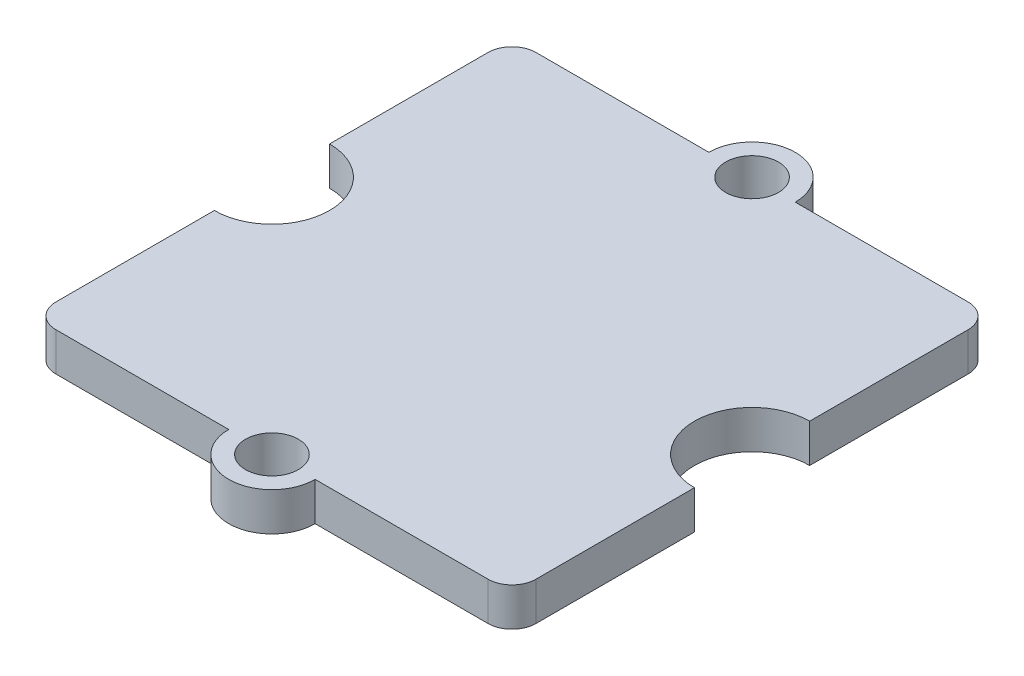
ISO-10303-21;
HEADER;
FILE_DESCRIPTION(('STEP AP214'),'2;1');
FILE_NAME('part.step','',(''),(''),'','','');
FILE_SCHEMA(('AUTOMOTIVE_DESIGN { 1 0 10303 214 1 1 1 1 }'));
ENDSEC;
DATA;
#1=APPLICATION_CONTEXT('core data for automotive mechanical design processes');
#2=APPLICATION_PROTOCOL_DEFINITION('international standard','automotive_design',2000,#1);
#3=PRODUCT_CONTEXT('',#1,'mechanical');
#4=PRODUCT('Part','Part','',(#3));
#5=PRODUCT_RELATED_PRODUCT_CATEGORY('part','',(#4));
#6=PRODUCT_DEFINITION_FORMATION('','',#4);
#7=PRODUCT_DEFINITION_CONTEXT('part definition',#1,'design');
#8=PRODUCT_DEFINITION('design','',#6,#7);
#9=PRODUCT_DEFINITION_SHAPE('','',#8);
#10=(LENGTH_UNIT() NAMED_UNIT(*) SI_UNIT(.MILLI.,.METRE.));
#11=(NAMED_UNIT(*) PLANE_ANGLE_UNIT() SI_UNIT($,.RADIAN.));
#12=(NAMED_UNIT(*) SI_UNIT($,.STERADIAN.) SOLID_ANGLE_UNIT());
#13=UNCERTAINTY_MEASURE_WITH_UNIT(LENGTH_MEASURE(1.E-05),#10,'distance_accuracy_value','');
#14=(GEOMETRIC_REPRESENTATION_CONTEXT(3) GLOBAL_UNCERTAINTY_ASSIGNED_CONTEXT((#13)) GLOBAL_UNIT_ASSIGNED_CONTEXT((#10,
#11,#12)) REPRESENTATION_CONTEXT('',''));
#15=CARTESIAN_POINT('',(0.,0.,0.));
#16=DIRECTION('',(0.,0.,1.));
#17=DIRECTION('',(1.,0.,0.));
#18=AXIS2_PLACEMENT_3D('',#15,#16,#17);
#19=CARTESIAN_POINT('',(0.,1.6,10.));
#20=DIRECTION('',(0.,-1.,0.));
#21=DIRECTION('',(0.,0.,-1.));
#22=AXIS2_PLACEMENT_3D('',#19,#20,#21);
#23=CYLINDRICAL_SURFACE('',#22,1.8);
#24=CARTESIAN_POINT('',(0.,0.,10.));
#25=DIRECTION('',(0.,1.,0.));
#26=DIRECTION('',(0.,0.,1.));
#27=AXIS2_PLACEMENT_3D('',#24,#25,#26);
#28=CIRCLE('',#27,1.8);
#29=CARTESIAN_POINT('',(-1.8,0.,10.));
#30=VERTEX_POINT('',#29);
#31=CARTESIAN_POINT('',(1.8,0.,10.));
#32=VERTEX_POINT('',#31);
#33=EDGE_CURVE('E187',#30,#32,#28,.T.);
#34=ORIENTED_EDGE('',*,*,#33,.T.);
#35=DIRECTION('',(0.,-1.,0.));
#36=VECTOR('',#35,1.);
#37=CARTESIAN_POINT('',(1.8,1.6,10.));
#38=LINE('',#37,#36);
#39=CARTESIAN_POINT('',(1.8,1.6,10.));
#40=VERTEX_POINT('',#39);
#41=EDGE_CURVE('E11',#40,#32,#38,.T.);
#42=ORIENTED_EDGE('',*,*,#41,.F.);
#43=CARTESIAN_POINT('',(0.,1.6,10.));
#44=DIRECTION('',(0.,1.,0.));
#45=DIRECTION('',(0.,0.,1.));
#46=AXIS2_PLACEMENT_3D('',#43,#44,#45);
#47=CIRCLE('',#46,1.8);
#48=CARTESIAN_POINT('',(-1.8,1.6,10.));
#49=VERTEX_POINT('',#48);
#50=EDGE_CURVE('E228',#49,#40,#47,.T.);
#51=ORIENTED_EDGE('',*,*,#50,.F.);
#52=DIRECTION('',(0.,-1.,0.));
#53=VECTOR('',#52,1.);
#54=CARTESIAN_POINT('',(-1.8,1.6,10.));
#55=LINE('',#54,#53);
#56=EDGE_CURVE('E186',#49,#30,#55,.T.);
#57=ORIENTED_EDGE('',*,*,#56,.T.);
#58=EDGE_LOOP('',(#34,#42,#51,#57));
#59=FACE_BOUND('',#58,.T.);
#60=ADVANCED_FACE('F36',(#59),#23,.T.);
#61=CARTESIAN_POINT('',(0.,1.6,10.));
#62=DIRECTION('',(0.,0.,-1.));
#63=DIRECTION('',(-1.,0.,0.));
#64=AXIS2_PLACEMENT_3D('',#61,#62,#63);
#65=PLANE('',#64);
#66=DIRECTION('',(1.,0.,0.));
#67=VECTOR('',#66,1.);
#68=CARTESIAN_POINT('',(0.,0.,10.));
#69=LINE('',#68,#67);
#70=CARTESIAN_POINT('',(8.99999999999999,0.,10.));
#71=VERTEX_POINT('',#70);
#72=EDGE_CURVE('E190',#32,#71,#69,.T.);
#73=ORIENTED_EDGE('',*,*,#72,.T.);
#74=DIRECTION('',(0.,-1.,0.));
#75=VECTOR('',#74,1.);
#76=CARTESIAN_POINT('',(8.99999999999999,1.6,10.));
#77=LINE('',#76,#75);
#78=CARTESIAN_POINT('',(8.99999999999999,1.6,10.));
#79=VERTEX_POINT('',#78);
#80=EDGE_CURVE('E44',#79,#71,#77,.T.);
#81=ORIENTED_EDGE('',*,*,#80,.F.);
#82=DIRECTION('',(1.,0.,0.));
#83=VECTOR('',#82,1.);
#84=CARTESIAN_POINT('',(0.,1.6,10.));
#85=LINE('',#84,#83);
#86=EDGE_CURVE('E115',#40,#79,#85,.T.);
#87=ORIENTED_EDGE('',*,*,#86,.F.);
#88=ORIENTED_EDGE('',*,*,#41,.T.);
#89=EDGE_LOOP('',(#73,#81,#87,#88));
#90=FACE_BOUND('',#89,.T.);
#91=ADVANCED_FACE('F308',(#90),#65,.F.);
#92=CARTESIAN_POINT('',(9.,1.6,9.00000000000001));
#93=DIRECTION('',(0.,-1.,0.));
#94=DIRECTION('',(0.,0.,-1.));
#95=AXIS2_PLACEMENT_3D('',#92,#93,#94);
#96=CYLINDRICAL_SURFACE('',#95,1.);
#97=CARTESIAN_POINT('',(9.,0.,9.00000000000001));
#98=DIRECTION('',(0.,1.,0.));
#99=DIRECTION('',(0.,0.,1.));
#100=AXIS2_PLACEMENT_3D('',#97,#98,#99);
#101=CIRCLE('',#100,1.);
#102=CARTESIAN_POINT('',(10.,0.,9.));
#103=VERTEX_POINT('',#102);
#104=EDGE_CURVE('E192',#71,#103,#101,.T.);
#105=ORIENTED_EDGE('',*,*,#104,.T.);
#106=DIRECTION('',(0.,-1.,0.));
#107=VECTOR('',#106,1.);
#108=CARTESIAN_POINT('',(10.,1.6,9.));
#109=LINE('',#108,#107);
#110=CARTESIAN_POINT('',(10.,1.6,9.));
#111=VERTEX_POINT('',#110);
#112=EDGE_CURVE('E250',#111,#103,#109,.T.);
#113=ORIENTED_EDGE('',*,*,#112,.F.);
#114=CARTESIAN_POINT('',(9.,1.6,9.00000000000001));
#115=DIRECTION('',(0.,1.,0.));
#116=DIRECTION('',(0.,0.,1.));
#117=AXIS2_PLACEMENT_3D('',#114,#115,#116);
#118=CIRCLE('',#117,1.);
#119=EDGE_CURVE('E258',#79,#111,#118,.T.);
#120=ORIENTED_EDGE('',*,*,#119,.F.);
#121=ORIENTED_EDGE('',*,*,#80,.T.);
#122=EDGE_LOOP('',(#105,#113,#120,#121));
#123=FACE_BOUND('',#122,.T.);
#124=ADVANCED_FACE('F256',(#123),#96,.T.);
#125=CARTESIAN_POINT('',(10.,1.6,0.));
#126=DIRECTION('',(-1.,0.,0.));
#127=DIRECTION('',(0.,0.,1.));
#128=AXIS2_PLACEMENT_3D('',#125,#126,#127);
#129=PLANE('',#128);
#130=DIRECTION('',(0.,0.,-1.));
#131=VECTOR('',#130,1.);
#132=CARTESIAN_POINT('',(10.,0.,0.));
#133=LINE('',#132,#131);
#134=CARTESIAN_POINT('',(10.,0.,2.40000000000001));
#135=VERTEX_POINT('',#134);
#136=EDGE_CURVE('E194',#103,#135,#133,.T.);
#137=ORIENTED_EDGE('',*,*,#136,.T.);
#138=DIRECTION('',(0.,-1.,0.));
#139=VECTOR('',#138,1.);
#140=CARTESIAN_POINT('',(10.,1.6,2.40000000000001));
#141=LINE('',#140,#139);
#142=CARTESIAN_POINT('',(10.,1.6,2.40000000000001));
#143=VERTEX_POINT('',#142);
#144=EDGE_CURVE('E248',#143,#135,#141,.T.);
#145=ORIENTED_EDGE('',*,*,#144,.F.);
#146=DIRECTION('',(0.,0.,-1.));
#147=VECTOR('',#146,1.);
#148=CARTESIAN_POINT('',(10.,1.6,0.));
#149=LINE('',#148,#147);
#150=EDGE_CURVE('E271',#111,#143,#149,.T.);
#151=ORIENTED_EDGE('',*,*,#150,.F.);
#152=ORIENTED_EDGE('',*,*,#112,.T.);
#153=EDGE_LOOP('',(#137,#145,#151,#152));
#154=FACE_BOUND('',#153,.T.);
#155=ADVANCED_FACE('F268',(#154),#129,.F.);
#156=CARTESIAN_POINT('',(10.,1.6,0.));
#157=DIRECTION('',(0.,-1.,0.));
#158=DIRECTION('',(0.,0.,-1.));
#159=AXIS2_PLACEMENT_3D('',#156,#157,#158);
#160=CYLINDRICAL_SURFACE('',#159,2.4);
#161=CARTESIAN_POINT('',(10.,0.,0.));
#162=DIRECTION('',(0.,1.,0.));
#163=DIRECTION('',(0.,0.,1.));
#164=AXIS2_PLACEMENT_3D('',#161,#162,#163);
#165=CIRCLE('',#164,2.4);
#166=CARTESIAN_POINT('',(10.,0.,-2.39999999999999));
#167=VERTEX_POINT('',#166);
#168=EDGE_CURVE('E197',#167,#135,#165,.T.);
#169=ORIENTED_EDGE('',*,*,#168,.F.);
#170=DIRECTION('',(0.,-1.,0.));
#171=VECTOR('',#170,1.);
#172=CARTESIAN_POINT('',(10.,1.6,-2.39999999999999));
#173=LINE('',#172,#171);
#174=CARTESIAN_POINT('',(10.,1.6,-2.39999999999999));
#175=VERTEX_POINT('',#174);
#176=EDGE_CURVE('E246',#175,#167,#173,.T.);
#177=ORIENTED_EDGE('',*,*,#176,.F.);
#178=CARTESIAN_POINT('',(10.,1.6,0.));
#179=DIRECTION('',(0.,1.,0.));
#180=DIRECTION('',(0.,0.,1.));
#181=AXIS2_PLACEMENT_3D('',#178,#179,#180);
#182=CIRCLE('',#181,2.4);
#183=EDGE_CURVE('E273',#175,#143,#182,.T.);
#184=ORIENTED_EDGE('',*,*,#183,.T.);
#185=ORIENTED_EDGE('',*,*,#144,.T.);
#186=EDGE_LOOP('',(#169,#177,#184,#185));
#187=FACE_BOUND('',#186,.T.);
#188=ADVANCED_FACE('F334',(#187),#160,.F.);
#189=CARTESIAN_POINT('',(10.,0.,-8.99999999999999));
#190=VERTEX_POINT('',#189);
#191=EDGE_CURVE('E198',#167,#190,#133,.T.);
#192=ORIENTED_EDGE('',*,*,#191,.T.);
#193=DIRECTION('',(0.,-1.,0.));
#194=VECTOR('',#193,1.);
#195=CARTESIAN_POINT('',(10.,1.6,-8.99999999999999));
#196=LINE('',#195,#194);
#197=CARTESIAN_POINT('',(10.,1.6,-8.99999999999999));
#198=VERTEX_POINT('',#197);
#199=EDGE_CURVE('E244',#198,#190,#196,.T.);
#200=ORIENTED_EDGE('',*,*,#199,.F.);
#201=EDGE_CURVE('E275',#175,#198,#149,.T.);
#202=ORIENTED_EDGE('',*,*,#201,.F.);
#203=ORIENTED_EDGE('',*,*,#176,.T.);
#204=EDGE_LOOP('',(#192,#200,#202,#203));
#205=FACE_BOUND('',#204,.T.);
#206=ADVANCED_FACE('F336',(#205),#129,.F.);
#207=CARTESIAN_POINT('',(9.,1.6,-8.99999999999999));
#208=DIRECTION('',(0.,-1.,0.));
#209=DIRECTION('',(0.,0.,-1.));
#210=AXIS2_PLACEMENT_3D('',#207,#208,#209);
#211=CYLINDRICAL_SURFACE('',#210,1.);
#212=CARTESIAN_POINT('',(9.,0.,-8.99999999999999));
#213=DIRECTION('',(0.,1.,0.));
#214=DIRECTION('',(0.,0.,1.));
#215=AXIS2_PLACEMENT_3D('',#212,#213,#214);
#216=CIRCLE('',#215,1.);
#217=CARTESIAN_POINT('',(8.99999999999999,0.,-9.99999999999999));
#218=VERTEX_POINT('',#217);
#219=EDGE_CURVE('E201',#218,#190,#216,.F.);
#220=ORIENTED_EDGE('',*,*,#219,.F.);
#221=DIRECTION('',(0.,-1.,0.));
#222=VECTOR('',#221,1.);
#223=CARTESIAN_POINT('',(8.99999999999999,1.6,-9.99999999999999));
#224=LINE('',#223,#222);
#225=CARTESIAN_POINT('',(8.99999999999999,1.6,-9.99999999999999));
#226=VERTEX_POINT('',#225);
#227=EDGE_CURVE('E242',#226,#218,#224,.T.);
#228=ORIENTED_EDGE('',*,*,#227,.F.);
#229=CARTESIAN_POINT('',(9.,1.6,-8.99999999999999));
#230=DIRECTION('',(0.,1.,0.));
#231=DIRECTION('',(0.,0.,1.));
#232=AXIS2_PLACEMENT_3D('',#229,#230,#231);
#233=CIRCLE('',#232,1.);
#234=EDGE_CURVE('E278',#226,#198,#233,.F.);
#235=ORIENTED_EDGE('',*,*,#234,.T.);
#236=ORIENTED_EDGE('',*,*,#199,.T.);
#237=EDGE_LOOP('',(#220,#228,#235,#236));
#238=FACE_BOUND('',#237,.T.);
#239=ADVANCED_FACE('F347',(#238),#211,.T.);
#240=CARTESIAN_POINT('',(0.,1.6,-9.99999999999999));
#241=DIRECTION('',(0.,0.,-1.));
#242=DIRECTION('',(-1.,0.,0.));
#243=AXIS2_PLACEMENT_3D('',#240,#241,#242);
#244=PLANE('',#243);
#245=DIRECTION('',(1.,0.,0.));
#246=VECTOR('',#245,1.);
#247=CARTESIAN_POINT('',(0.,0.,-9.99999999999999));
#248=LINE('',#247,#246);
#249=CARTESIAN_POINT('',(1.8,0.,-9.99999999999999));
#250=VERTEX_POINT('',#249);
#251=EDGE_CURVE('E204',#250,#218,#248,.T.);
#252=ORIENTED_EDGE('',*,*,#251,.F.);
#253=DIRECTION('',(0.,-1.,0.));
#254=VECTOR('',#253,1.);
#255=CARTESIAN_POINT('',(1.8,1.6,-9.99999999999999));
#256=LINE('',#255,#254);
#257=CARTESIAN_POINT('',(1.8,1.6,-9.99999999999999));
#258=VERTEX_POINT('',#257);
#259=EDGE_CURVE('E240',#258,#250,#256,.T.);
#260=ORIENTED_EDGE('',*,*,#259,.F.);
#261=DIRECTION('',(1.,0.,0.));
#262=VECTOR('',#261,1.);
#263=CARTESIAN_POINT('',(0.,1.6,-9.99999999999999));
#264=LINE('',#263,#262);
#265=EDGE_CURVE('E283',#258,#226,#264,.T.);
#266=ORIENTED_EDGE('',*,*,#265,.T.);
#267=ORIENTED_EDGE('',*,*,#227,.T.);
#268=EDGE_LOOP('',(#252,#260,#266,#267));
#269=FACE_BOUND('',#268,.T.);
#270=ADVANCED_FACE('F353',(#269),#244,.T.);
#271=CARTESIAN_POINT('',(0.,1.6,-9.99999999999999));
#272=DIRECTION('',(0.,-1.,0.));
#273=DIRECTION('',(0.,0.,-1.));
#274=AXIS2_PLACEMENT_3D('',#271,#272,#273);
#275=CYLINDRICAL_SURFACE('',#274,1.8);
#276=CARTESIAN_POINT('',(0.,0.,-9.99999999999999));
#277=DIRECTION('',(0.,1.,0.));
#278=DIRECTION('',(0.,0.,1.));
#279=AXIS2_PLACEMENT_3D('',#276,#277,#278);
#280=CIRCLE('',#279,1.8);
#281=CARTESIAN_POINT('',(-1.8,0.,-9.99999999999999));
#282=VERTEX_POINT('',#281);
#283=EDGE_CURVE('E207',#250,#282,#280,.T.);
#284=ORIENTED_EDGE('',*,*,#283,.T.);
#285=DIRECTION('',(0.,-1.,0.));
#286=VECTOR('',#285,1.);
#287=CARTESIAN_POINT('',(-1.8,1.6,-9.99999999999999));
#288=LINE('',#287,#286);
#289=CARTESIAN_POINT('',(-1.8,1.6,-9.99999999999999));
#290=VERTEX_POINT('',#289);
#291=EDGE_CURVE('E238',#290,#282,#288,.T.);
#292=ORIENTED_EDGE('',*,*,#291,.F.);
#293=CARTESIAN_POINT('',(0.,1.6,-9.99999999999999));
#294=DIRECTION('',(0.,1.,0.));
#295=DIRECTION('',(0.,0.,1.));
#296=AXIS2_PLACEMENT_3D('',#293,#294,#295);
#297=CIRCLE('',#296,1.8);
#298=EDGE_CURVE('E287',#258,#290,#297,.T.);
#299=ORIENTED_EDGE('',*,*,#298,.F.);
#300=ORIENTED_EDGE('',*,*,#259,.T.);
#301=EDGE_LOOP('',(#284,#292,#299,#300));
#302=FACE_BOUND('',#301,.T.);
#303=ADVANCED_FACE('F359',(#302),#275,.T.);
#304=CARTESIAN_POINT('',(-8.99999999999999,0.,-9.99999999999999));
#305=VERTEX_POINT('',#304);
#306=EDGE_CURVE('E208',#305,#282,#248,.T.);
#307=ORIENTED_EDGE('',*,*,#306,.F.);
#308=DIRECTION('',(0.,-1.,0.));
#309=VECTOR('',#308,1.);
#310=CARTESIAN_POINT('',(-8.99999999999999,1.6,-9.99999999999999));
#311=LINE('',#310,#309);
#312=CARTESIAN_POINT('',(-8.99999999999999,1.6,-9.99999999999999));
#313=VERTEX_POINT('',#312);
#314=EDGE_CURVE('E236',#313,#305,#311,.T.);
#315=ORIENTED_EDGE('',*,*,#314,.F.);
#316=EDGE_CURVE('E289',#313,#290,#264,.T.);
#317=ORIENTED_EDGE('',*,*,#316,.T.);
#318=ORIENTED_EDGE('',*,*,#291,.T.);
#319=EDGE_LOOP('',(#307,#315,#317,#318));
#320=FACE_BOUND('',#319,.T.);
#321=ADVANCED_FACE('F362',(#320),#244,.T.);
#322=CARTESIAN_POINT('',(-9.,1.6,-8.99999999999999));
#323=DIRECTION('',(0.,-1.,0.));
#324=DIRECTION('',(0.,0.,-1.));
#325=AXIS2_PLACEMENT_3D('',#322,#323,#324);
#326=CYLINDRICAL_SURFACE('',#325,1.);
#327=CARTESIAN_POINT('',(-9.,0.,-8.99999999999999));
#328=DIRECTION('',(0.,1.,0.));
#329=DIRECTION('',(0.,0.,1.));
#330=AXIS2_PLACEMENT_3D('',#327,#328,#329);
#331=CIRCLE('',#330,1.);
#332=CARTESIAN_POINT('',(-10.,0.,-8.99999999999999));
#333=VERTEX_POINT('',#332);
#334=EDGE_CURVE('E211',#333,#305,#331,.F.);
#335=ORIENTED_EDGE('',*,*,#334,.F.);
#336=DIRECTION('',(0.,-1.,0.));
#337=VECTOR('',#336,1.);
#338=CARTESIAN_POINT('',(-10.,1.6,-8.99999999999999));
#339=LINE('',#338,#337);
#340=CARTESIAN_POINT('',(-10.,1.6,-8.99999999999999));
#341=VERTEX_POINT('',#340);
#342=EDGE_CURVE('E234',#341,#333,#339,.T.);
#343=ORIENTED_EDGE('',*,*,#342,.F.);
#344=CARTESIAN_POINT('',(-9.,1.6,-8.99999999999999));
#345=DIRECTION('',(0.,1.,0.));
#346=DIRECTION('',(0.,0.,1.));
#347=AXIS2_PLACEMENT_3D('',#344,#345,#346);
#348=CIRCLE('',#347,1.);
#349=EDGE_CURVE('E292',#341,#313,#348,.F.);
#350=ORIENTED_EDGE('',*,*,#349,.T.);
#351=ORIENTED_EDGE('',*,*,#314,.T.);
#352=EDGE_LOOP('',(#335,#343,#350,#351));
#353=FACE_BOUND('',#352,.T.);
#354=ADVANCED_FACE('F373',(#353),#326,.T.);
#355=CARTESIAN_POINT('',(-10.,1.6,0.));
#356=DIRECTION('',(-1.,0.,0.));
#357=DIRECTION('',(0.,0.,1.));
#358=AXIS2_PLACEMENT_3D('',#355,#356,#357);
#359=PLANE('',#358);
#360=DIRECTION('',(0.,0.,-1.));
#361=VECTOR('',#360,1.);
#362=CARTESIAN_POINT('',(-10.,0.,0.));
#363=LINE('',#362,#361);
#364=CARTESIAN_POINT('',(-10.,0.,-2.39999999999999));
#365=VERTEX_POINT('',#364);
#366=EDGE_CURVE('E214',#365,#333,#363,.T.);
#367=ORIENTED_EDGE('',*,*,#366,.F.);
#368=DIRECTION('',(0.,-1.,0.));
#369=VECTOR('',#368,1.);
#370=CARTESIAN_POINT('',(-10.,1.6,-2.39999999999999));
#371=LINE('',#370,#369);
#372=CARTESIAN_POINT('',(-10.,1.6,-2.39999999999999));
#373=VERTEX_POINT('',#372);
#374=EDGE_CURVE('E232',#373,#365,#371,.T.);
#375=ORIENTED_EDGE('',*,*,#374,.F.);
#376=DIRECTION('',(0.,0.,-1.));
#377=VECTOR('',#376,1.);
#378=CARTESIAN_POINT('',(-10.,1.6,0.));
#379=LINE('',#378,#377);
#380=EDGE_CURVE('E174',#373,#341,#379,.T.);
#381=ORIENTED_EDGE('',*,*,#380,.T.);
#382=ORIENTED_EDGE('',*,*,#342,.T.);
#383=EDGE_LOOP('',(#367,#375,#381,#382));
#384=FACE_BOUND('',#383,.T.);
#385=ADVANCED_FACE('F379',(#384),#359,.T.);
#386=CARTESIAN_POINT('',(-10.,1.6,0.));
#387=DIRECTION('',(0.,-1.,0.));
#388=DIRECTION('',(0.,0.,-1.));
#389=AXIS2_PLACEMENT_3D('',#386,#387,#388);
#390=CYLINDRICAL_SURFACE('',#389,2.4);
#391=CARTESIAN_POINT('',(-10.,0.,0.));
#392=DIRECTION('',(0.,1.,0.));
#393=DIRECTION('',(0.,0.,1.));
#394=AXIS2_PLACEMENT_3D('',#391,#392,#393);
#395=CIRCLE('',#394,2.4);
#396=CARTESIAN_POINT('',(-10.,0.,2.40000000000001));
#397=VERTEX_POINT('',#396);
#398=EDGE_CURVE('E217',#397,#365,#395,.T.);
#399=ORIENTED_EDGE('',*,*,#398,.F.);
#400=DIRECTION('',(0.,-1.,0.));
#401=VECTOR('',#400,1.);
#402=CARTESIAN_POINT('',(-10.,1.6,2.40000000000001));
#403=LINE('',#402,#401);
#404=CARTESIAN_POINT('',(-10.,1.6,2.40000000000001));
#405=VERTEX_POINT('',#404);
#406=EDGE_CURVE('E164',#405,#397,#403,.T.);
#407=ORIENTED_EDGE('',*,*,#406,.F.);
#408=CARTESIAN_POINT('',(-10.,1.6,0.));
#409=DIRECTION('',(0.,1.,0.));
#410=DIRECTION('',(0.,0.,1.));
#411=AXIS2_PLACEMENT_3D('',#408,#409,#410);
#412=CIRCLE('',#411,2.4);
#413=EDGE_CURVE('E172',#405,#373,#412,.T.);
#414=ORIENTED_EDGE('',*,*,#413,.T.);
#415=ORIENTED_EDGE('',*,*,#374,.T.);
#416=EDGE_LOOP('',(#399,#407,#414,#415));
#417=FACE_BOUND('',#416,.T.);
#418=ADVANCED_FACE('F298',(#417),#390,.F.);
#419=CARTESIAN_POINT('',(-10.,0.,9.));
#420=VERTEX_POINT('',#419);
#421=EDGE_CURVE('E159',#420,#397,#363,.T.);
#422=ORIENTED_EDGE('',*,*,#421,.F.);
#423=DIRECTION('',(0.,-1.,0.));
#424=VECTOR('',#423,1.);
#425=CARTESIAN_POINT('',(-10.,1.6,9.));
#426=LINE('',#425,#424);
#427=CARTESIAN_POINT('',(-10.,1.6,9.));
#428=VERTEX_POINT('',#427);
#429=EDGE_CURVE('E154',#428,#420,#426,.T.);
#430=ORIENTED_EDGE('',*,*,#429,.F.);
#431=EDGE_CURVE('E157',#428,#405,#379,.T.);
#432=ORIENTED_EDGE('',*,*,#431,.T.);
#433=ORIENTED_EDGE('',*,*,#406,.T.);
#434=EDGE_LOOP('',(#422,#430,#432,#433));
#435=FACE_BOUND('',#434,.T.);
#436=ADVANCED_FACE('F156',(#435),#359,.T.);
#437=CARTESIAN_POINT('',(-9.,1.6,9.00000000000001));
#438=DIRECTION('',(0.,-1.,0.));
#439=DIRECTION('',(0.,0.,-1.));
#440=AXIS2_PLACEMENT_3D('',#437,#438,#439);
#441=CYLINDRICAL_SURFACE('',#440,1.);
#442=CARTESIAN_POINT('',(-9.,0.,9.00000000000001));
#443=DIRECTION('',(0.,1.,0.));
#444=DIRECTION('',(0.,0.,1.));
#445=AXIS2_PLACEMENT_3D('',#442,#443,#444);
#446=CIRCLE('',#445,1.);
#447=CARTESIAN_POINT('',(-8.99999999999999,0.,10.));
#448=VERTEX_POINT('',#447);
#449=EDGE_CURVE('E220',#448,#420,#446,.F.);
#450=ORIENTED_EDGE('',*,*,#449,.F.);
#451=DIRECTION('',(0.,-1.,0.));
#452=VECTOR('',#451,1.);
#453=CARTESIAN_POINT('',(-8.99999999999999,1.6,10.));
#454=LINE('',#453,#452);
#455=CARTESIAN_POINT('',(-8.99999999999999,1.6,10.));
#456=VERTEX_POINT('',#455);
#457=EDGE_CURVE('E104',#456,#448,#454,.T.);
#458=ORIENTED_EDGE('',*,*,#457,.F.);
#459=CARTESIAN_POINT('',(-9.,1.6,9.00000000000001));
#460=DIRECTION('',(0.,1.,0.));
#461=DIRECTION('',(0.,0.,1.));
#462=AXIS2_PLACEMENT_3D('',#459,#460,#461);
#463=CIRCLE('',#462,1.);
#464=EDGE_CURVE('E169',#456,#428,#463,.F.);
#465=ORIENTED_EDGE('',*,*,#464,.T.);
#466=ORIENTED_EDGE('',*,*,#429,.T.);
#467=EDGE_LOOP('',(#450,#458,#465,#466));
#468=FACE_BOUND('',#467,.T.);
#469=ADVANCED_FACE('F175',(#468),#441,.T.);
#470=CARTESIAN_POINT('',(0.,1.6,-9.99999999999999));
#471=DIRECTION('',(0.,-1.,0.));
#472=DIRECTION('',(0.,0.,-1.));
#473=AXIS2_PLACEMENT_3D('',#470,#471,#472);
#474=CYLINDRICAL_SURFACE('',#473,1.1);
#475=CARTESIAN_POINT('',(0.,1.6,-9.99999999999999));
#476=DIRECTION('',(0.,1.,0.));
#477=DIRECTION('',(0.,0.,1.));
#478=AXIS2_PLACEMENT_3D('',#475,#476,#477);
#479=CIRCLE('',#478,1.1);
#480=CARTESIAN_POINT('',(0.,1.6,-8.9));
#481=VERTEX_POINT('',#480);
#482=EDGE_CURVE('E177',#481,#481,#479,.T.);
#483=ORIENTED_EDGE('',*,*,#482,.T.);
#484=EDGE_LOOP('',(#483));
#485=FACE_BOUND('',#484,.T.);
#486=CARTESIAN_POINT('',(0.,0.,-9.99999999999999));
#487=DIRECTION('',(0.,1.,0.));
#488=DIRECTION('',(0.,0.,1.));
#489=AXIS2_PLACEMENT_3D('',#486,#487,#488);
#490=CIRCLE('',#489,1.1);
#491=CARTESIAN_POINT('',(0.,0.,-8.9));
#492=VERTEX_POINT('',#491);
#493=EDGE_CURVE('E222',#492,#492,#490,.T.);
#494=ORIENTED_EDGE('',*,*,#493,.F.);
#495=EDGE_LOOP('',(#494));
#496=FACE_BOUND('',#495,.T.);
#497=ADVANCED_FACE('F306',(#485,#496),#474,.F.);
#498=EDGE_CURVE('E107',#448,#30,#69,.T.);
#499=ORIENTED_EDGE('',*,*,#498,.T.);
#500=ORIENTED_EDGE('',*,*,#56,.F.);
#501=EDGE_CURVE('E52',#456,#49,#85,.T.);
#502=ORIENTED_EDGE('',*,*,#501,.F.);
#503=ORIENTED_EDGE('',*,*,#457,.T.);
#504=EDGE_LOOP('',(#499,#500,#502,#503));
#505=FACE_BOUND('',#504,.T.);
#506=ADVANCED_FACE('F303',(#505),#65,.F.);
#507=CARTESIAN_POINT('',(0.,1.6,10.));
#508=DIRECTION('',(0.,-1.,0.));
#509=DIRECTION('',(0.,0.,-1.));
#510=AXIS2_PLACEMENT_3D('',#507,#508,#509);
#511=CYLINDRICAL_SURFACE('',#510,1.1);
#512=CARTESIAN_POINT('',(0.,1.6,10.));
#513=DIRECTION('',(0.,1.,0.));
#514=DIRECTION('',(0.,0.,1.));
#515=AXIS2_PLACEMENT_3D('',#512,#513,#514);
#516=CIRCLE('',#515,1.1);
#517=CARTESIAN_POINT('',(0.,1.6,11.1));
#518=VERTEX_POINT('',#517);
#519=EDGE_CURVE('E183',#518,#518,#516,.T.);
#520=ORIENTED_EDGE('',*,*,#519,.T.);
#521=EDGE_LOOP('',(#520));
#522=FACE_BOUND('',#521,.T.);
#523=CARTESIAN_POINT('',(0.,0.,10.));
#524=DIRECTION('',(0.,1.,0.));
#525=DIRECTION('',(0.,0.,1.));
#526=AXIS2_PLACEMENT_3D('',#523,#524,#525);
#527=CIRCLE('',#526,1.1);
#528=CARTESIAN_POINT('',(0.,0.,11.1));
#529=VERTEX_POINT('',#528);
#530=EDGE_CURVE('E225',#529,#529,#527,.T.);
#531=ORIENTED_EDGE('',*,*,#530,.F.);
#532=EDGE_LOOP('',(#531));
#533=FACE_BOUND('',#532,.T.);
#534=ADVANCED_FACE('F305',(#522,#533),#511,.F.);
#535=CARTESIAN_POINT('',(0.,1.6,0.));
#536=DIRECTION('',(0.,1.,0.));
#537=DIRECTION('',(0.,0.,1.));
#538=AXIS2_PLACEMENT_3D('',#535,#536,#537);
#539=PLANE('',#538);
#540=ORIENTED_EDGE('',*,*,#50,.T.);
#541=ORIENTED_EDGE('',*,*,#86,.T.);
#542=ORIENTED_EDGE('',*,*,#119,.T.);
#543=ORIENTED_EDGE('',*,*,#150,.T.);
#544=ORIENTED_EDGE('',*,*,#183,.F.);
#545=ORIENTED_EDGE('',*,*,#201,.T.);
#546=ORIENTED_EDGE('',*,*,#234,.F.);
#547=ORIENTED_EDGE('',*,*,#265,.F.);
#548=ORIENTED_EDGE('',*,*,#298,.T.);
#549=ORIENTED_EDGE('',*,*,#316,.F.);
#550=ORIENTED_EDGE('',*,*,#349,.F.);
#551=ORIENTED_EDGE('',*,*,#380,.F.);
#552=ORIENTED_EDGE('',*,*,#413,.F.);
#553=ORIENTED_EDGE('',*,*,#431,.F.);
#554=ORIENTED_EDGE('',*,*,#464,.F.);
#555=ORIENTED_EDGE('',*,*,#501,.T.);
#556=EDGE_LOOP('',(#540,#541,#542,#543,#544,#545,#546,#547,#548,#549,#550,#551,#552,#553,#554,#555));
#557=FACE_BOUND('',#556,.T.);
#558=ORIENTED_EDGE('',*,*,#482,.F.);
#559=EDGE_LOOP('',(#558));
#560=FACE_BOUND('',#559,.T.);
#561=ORIENTED_EDGE('',*,*,#519,.F.);
#562=EDGE_LOOP('',(#561));
#563=FACE_BOUND('',#562,.T.);
#564=ADVANCED_FACE('F167',(#557,#560,#563),#539,.T.);
#565=CARTESIAN_POINT('',(0.,0.,0.));
#566=DIRECTION('',(0.,1.,0.));
#567=DIRECTION('',(0.,0.,1.));
#568=AXIS2_PLACEMENT_3D('',#565,#566,#567);
#569=PLANE('',#568);
#570=ORIENTED_EDGE('',*,*,#33,.F.);
#571=ORIENTED_EDGE('',*,*,#498,.F.);
#572=ORIENTED_EDGE('',*,*,#449,.T.);
#573=ORIENTED_EDGE('',*,*,#421,.T.);
#574=ORIENTED_EDGE('',*,*,#398,.T.);
#575=ORIENTED_EDGE('',*,*,#366,.T.);
#576=ORIENTED_EDGE('',*,*,#334,.T.);
#577=ORIENTED_EDGE('',*,*,#306,.T.);
#578=ORIENTED_EDGE('',*,*,#283,.F.);
#579=ORIENTED_EDGE('',*,*,#251,.T.);
#580=ORIENTED_EDGE('',*,*,#219,.T.);
#581=ORIENTED_EDGE('',*,*,#191,.F.);
#582=ORIENTED_EDGE('',*,*,#168,.T.);
#583=ORIENTED_EDGE('',*,*,#136,.F.);
#584=ORIENTED_EDGE('',*,*,#104,.F.);
#585=ORIENTED_EDGE('',*,*,#72,.F.);
#586=EDGE_LOOP('',(#570,#571,#572,#573,#574,#575,#576,#577,#578,#579,#580,#581,#582,#583,#584,#585));
#587=FACE_BOUND('',#586,.T.);
#588=ORIENTED_EDGE('',*,*,#493,.T.);
#589=EDGE_LOOP('',(#588));
#590=FACE_BOUND('',#589,.T.);
#591=ORIENTED_EDGE('',*,*,#530,.T.);
#592=EDGE_LOOP('',(#591));
#593=FACE_BOUND('',#592,.T.);
#594=ADVANCED_FACE('F262',(#587,#590,#593),#569,.F.);
#595=CLOSED_SHELL('',(#60,#91,#124,#155,#188,#206,#239,#270,#303,#321,#354,#385,#418,#436,#469,
#497,#506,#534,#564,#594));
#596=MANIFOLD_SOLID_BREP('B2',#595);
#597=ADVANCED_BREP_SHAPE_REPRESENTATION('',(#18,#596),#14);
#598=SHAPE_DEFINITION_REPRESENTATION(#9,#597);
ENDSEC;
END-ISO-10303-21;
